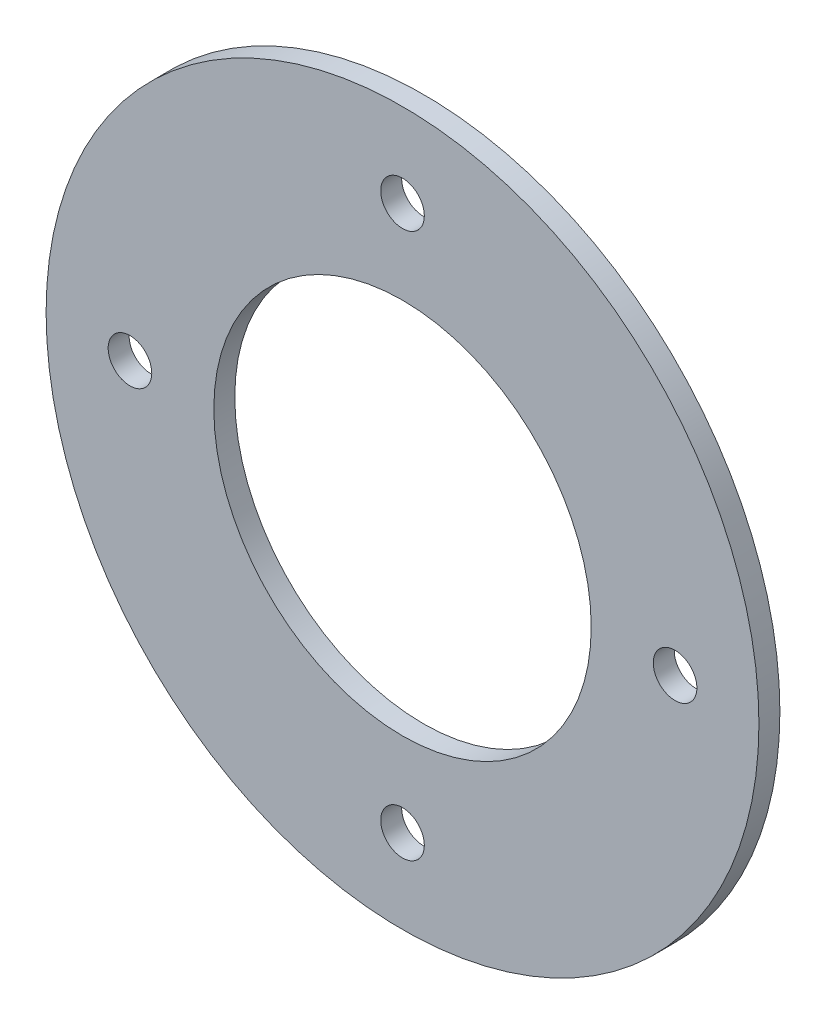
ISO-10303-21;
HEADER;
FILE_DESCRIPTION(('STEP AP214'),'2;1');
FILE_NAME('part.step','',(''),(''),'','','');
FILE_SCHEMA(('AUTOMOTIVE_DESIGN { 1 0 10303 214 1 1 1 1 }'));
ENDSEC;
DATA;
#1=APPLICATION_CONTEXT('core data for automotive mechanical design processes');
#2=APPLICATION_PROTOCOL_DEFINITION('international standard','automotive_design',2000,#1);
#3=PRODUCT_CONTEXT('',#1,'mechanical');
#4=PRODUCT('Part','Part','',(#3));
#5=PRODUCT_RELATED_PRODUCT_CATEGORY('part','',(#4));
#6=PRODUCT_DEFINITION_FORMATION('','',#4);
#7=PRODUCT_DEFINITION_CONTEXT('part definition',#1,'design');
#8=PRODUCT_DEFINITION('design','',#6,#7);
#9=PRODUCT_DEFINITION_SHAPE('','',#8);
#10=(LENGTH_UNIT() NAMED_UNIT(*) SI_UNIT(.MILLI.,.METRE.));
#11=(NAMED_UNIT(*) PLANE_ANGLE_UNIT() SI_UNIT($,.RADIAN.));
#12=(NAMED_UNIT(*) SI_UNIT($,.STERADIAN.) SOLID_ANGLE_UNIT());
#13=UNCERTAINTY_MEASURE_WITH_UNIT(LENGTH_MEASURE(1.E-05),#10,'distance_accuracy_value','');
#14=(GEOMETRIC_REPRESENTATION_CONTEXT(3) GLOBAL_UNCERTAINTY_ASSIGNED_CONTEXT((#13)) GLOBAL_UNIT_ASSIGNED_CONTEXT((#10,
#11,#12)) REPRESENTATION_CONTEXT('',''));
#15=CARTESIAN_POINT('',(0.,0.,0.));
#16=DIRECTION('',(0.,0.,1.));
#17=DIRECTION('',(1.,0.,0.));
#18=AXIS2_PLACEMENT_3D('',#15,#16,#17);
#19=CARTESIAN_POINT('',(0.,0.,-1.5875));
#20=DIRECTION('',(0.,0.,1.));
#21=DIRECTION('',(1.,0.,0.));
#22=AXIS2_PLACEMENT_3D('',#19,#20,#21);
#23=CYLINDRICAL_SURFACE('',#22,26.9875);
#24=CARTESIAN_POINT('',(0.,0.,-1.5875));
#25=DIRECTION('',(0.,0.,1.));
#26=DIRECTION('',(1.,0.,0.));
#27=AXIS2_PLACEMENT_3D('',#24,#25,#26);
#28=CIRCLE('',#27,26.9875);
#29=CARTESIAN_POINT('',(26.9875,0.,-1.5875));
#30=VERTEX_POINT('',#29);
#31=EDGE_CURVE('E10',#30,#30,#28,.T.);
#32=ORIENTED_EDGE('',*,*,#31,.T.);
#33=EDGE_LOOP('',(#32));
#34=FACE_BOUND('',#33,.T.);
#35=CARTESIAN_POINT('',(0.,0.,0.));
#36=DIRECTION('',(0.,0.,1.));
#37=DIRECTION('',(1.,0.,0.));
#38=AXIS2_PLACEMENT_3D('',#35,#36,#37);
#39=CIRCLE('',#38,26.9875);
#40=CARTESIAN_POINT('',(26.9875,0.,0.));
#41=VERTEX_POINT('',#40);
#42=EDGE_CURVE('E37',#41,#41,#39,.T.);
#43=ORIENTED_EDGE('',*,*,#42,.F.);
#44=EDGE_LOOP('',(#43));
#45=FACE_BOUND('',#44,.T.);
#46=ADVANCED_FACE('F34',(#34,#45),#23,.T.);
#47=CARTESIAN_POINT('',(0.,0.,-1.5875));
#48=DIRECTION('',(0.,0.,1.));
#49=DIRECTION('',(1.,0.,0.));
#50=AXIS2_PLACEMENT_3D('',#47,#48,#49);
#51=PLANE('',#50);
#52=CARTESIAN_POINT('',(0.,20.6375,-1.5875));
#53=DIRECTION('',(0.,0.,1.));
#54=DIRECTION('',(1.,0.,0.));
#55=AXIS2_PLACEMENT_3D('',#52,#53,#54);
#56=CIRCLE('',#55,1.651);
#57=CARTESIAN_POINT('',(1.651,20.6375,-1.5875));
#58=VERTEX_POINT('',#57);
#59=EDGE_CURVE('E49',#58,#58,#56,.T.);
#60=ORIENTED_EDGE('',*,*,#59,.T.);
#61=EDGE_LOOP('',(#60));
#62=FACE_BOUND('',#61,.T.);
#63=CARTESIAN_POINT('',(20.6375,0.,-1.5875));
#64=DIRECTION('',(0.,0.,1.));
#65=DIRECTION('',(1.,0.,0.));
#66=AXIS2_PLACEMENT_3D('',#63,#64,#65);
#67=CIRCLE('',#66,1.651);
#68=CARTESIAN_POINT('',(22.2885,0.,-1.5875));
#69=VERTEX_POINT('',#68);
#70=EDGE_CURVE('E67',#69,#69,#67,.T.);
#71=ORIENTED_EDGE('',*,*,#70,.T.);
#72=EDGE_LOOP('',(#71));
#73=FACE_BOUND('',#72,.T.);
#74=CARTESIAN_POINT('',(0.,-20.6375,-1.5875));
#75=DIRECTION('',(0.,0.,1.));
#76=DIRECTION('',(1.,0.,0.));
#77=AXIS2_PLACEMENT_3D('',#74,#75,#76);
#78=CIRCLE('',#77,1.651);
#79=CARTESIAN_POINT('',(1.651,-20.6375,-1.5875));
#80=VERTEX_POINT('',#79);
#81=EDGE_CURVE('E61',#80,#80,#78,.T.);
#82=ORIENTED_EDGE('',*,*,#81,.T.);
#83=EDGE_LOOP('',(#82));
#84=FACE_BOUND('',#83,.T.);
#85=CARTESIAN_POINT('',(-20.6375,0.,-1.5875));
#86=DIRECTION('',(0.,0.,1.));
#87=DIRECTION('',(1.,0.,0.));
#88=AXIS2_PLACEMENT_3D('',#85,#86,#87);
#89=CIRCLE('',#88,1.651);
#90=CARTESIAN_POINT('',(-18.9865,0.,-1.5875));
#91=VERTEX_POINT('',#90);
#92=EDGE_CURVE('E55',#91,#91,#89,.T.);
#93=ORIENTED_EDGE('',*,*,#92,.T.);
#94=EDGE_LOOP('',(#93));
#95=FACE_BOUND('',#94,.T.);
#96=CARTESIAN_POINT('',(0.,0.,-1.5875));
#97=DIRECTION('',(0.,0.,1.));
#98=DIRECTION('',(1.,0.,0.));
#99=AXIS2_PLACEMENT_3D('',#96,#97,#98);
#100=CIRCLE('',#99,14.2875);
#101=CARTESIAN_POINT('',(14.2875,0.,-1.5875));
#102=VERTEX_POINT('',#101);
#103=EDGE_CURVE('E44',#102,#102,#100,.T.);
#104=ORIENTED_EDGE('',*,*,#103,.T.);
#105=EDGE_LOOP('',(#104));
#106=FACE_BOUND('',#105,.T.);
#107=ORIENTED_EDGE('',*,*,#31,.F.);
#108=EDGE_LOOP('',(#107));
#109=FACE_BOUND('',#108,.T.);
#110=ADVANCED_FACE('F76',(#62,#73,#84,#95,#106,#109),#51,.F.);
#111=CARTESIAN_POINT('',(0.,0.,0.));
#112=DIRECTION('',(0.,0.,1.));
#113=DIRECTION('',(1.,0.,0.));
#114=AXIS2_PLACEMENT_3D('',#111,#112,#113);
#115=PLANE('',#114);
#116=CARTESIAN_POINT('',(0.,20.6375,0.));
#117=DIRECTION('',(0.,0.,1.));
#118=DIRECTION('',(1.,0.,0.));
#119=AXIS2_PLACEMENT_3D('',#116,#117,#118);
#120=CIRCLE('',#119,1.651);
#121=CARTESIAN_POINT('',(1.651,20.6375,0.));
#122=VERTEX_POINT('',#121);
#123=EDGE_CURVE('E70',#122,#122,#120,.T.);
#124=ORIENTED_EDGE('',*,*,#123,.F.);
#125=EDGE_LOOP('',(#124));
#126=FACE_BOUND('',#125,.T.);
#127=CARTESIAN_POINT('',(20.6375,0.,0.));
#128=DIRECTION('',(0.,0.,1.));
#129=DIRECTION('',(1.,0.,0.));
#130=AXIS2_PLACEMENT_3D('',#127,#128,#129);
#131=CIRCLE('',#130,1.651);
#132=CARTESIAN_POINT('',(22.2885,0.,0.));
#133=VERTEX_POINT('',#132);
#134=EDGE_CURVE('E64',#133,#133,#131,.T.);
#135=ORIENTED_EDGE('',*,*,#134,.F.);
#136=EDGE_LOOP('',(#135));
#137=FACE_BOUND('',#136,.T.);
#138=CARTESIAN_POINT('',(0.,-20.6375,0.));
#139=DIRECTION('',(0.,0.,1.));
#140=DIRECTION('',(1.,0.,0.));
#141=AXIS2_PLACEMENT_3D('',#138,#139,#140);
#142=CIRCLE('',#141,1.651);
#143=CARTESIAN_POINT('',(1.651,-20.6375,0.));
#144=VERTEX_POINT('',#143);
#145=EDGE_CURVE('E58',#144,#144,#142,.T.);
#146=ORIENTED_EDGE('',*,*,#145,.F.);
#147=EDGE_LOOP('',(#146));
#148=FACE_BOUND('',#147,.T.);
#149=CARTESIAN_POINT('',(-20.6375,0.,0.));
#150=DIRECTION('',(0.,0.,1.));
#151=DIRECTION('',(1.,0.,0.));
#152=AXIS2_PLACEMENT_3D('',#149,#150,#151);
#153=CIRCLE('',#152,1.651);
#154=CARTESIAN_POINT('',(-18.9865,0.,0.));
#155=VERTEX_POINT('',#154);
#156=EDGE_CURVE('E52',#155,#155,#153,.T.);
#157=ORIENTED_EDGE('',*,*,#156,.F.);
#158=EDGE_LOOP('',(#157));
#159=FACE_BOUND('',#158,.T.);
#160=CARTESIAN_POINT('',(0.,0.,0.));
#161=DIRECTION('',(0.,0.,1.));
#162=DIRECTION('',(1.,0.,0.));
#163=AXIS2_PLACEMENT_3D('',#160,#161,#162);
#164=CIRCLE('',#163,14.2875);
#165=CARTESIAN_POINT('',(14.2875,0.,0.));
#166=VERTEX_POINT('',#165);
#167=EDGE_CURVE('E46',#166,#166,#164,.T.);
#168=ORIENTED_EDGE('',*,*,#167,.F.);
#169=EDGE_LOOP('',(#168));
#170=FACE_BOUND('',#169,.T.);
#171=ORIENTED_EDGE('',*,*,#42,.T.);
#172=EDGE_LOOP('',(#171));
#173=FACE_BOUND('',#172,.T.);
#174=ADVANCED_FACE('F86',(#126,#137,#148,#159,#170,#173),#115,.T.);
#175=CARTESIAN_POINT('',(0.,0.,-1.5875));
#176=DIRECTION('',(0.,0.,1.));
#177=DIRECTION('',(1.,0.,0.));
#178=AXIS2_PLACEMENT_3D('',#175,#176,#177);
#179=CYLINDRICAL_SURFACE('',#178,14.2875);
#180=ORIENTED_EDGE('',*,*,#103,.F.);
#181=EDGE_LOOP('',(#180));
#182=FACE_BOUND('',#181,.T.);
#183=ORIENTED_EDGE('',*,*,#167,.T.);
#184=EDGE_LOOP('',(#183));
#185=FACE_BOUND('',#184,.T.);
#186=ADVANCED_FACE('F89',(#182,#185),#179,.F.);
#187=CARTESIAN_POINT('',(-20.6375,0.,-1.5875));
#188=DIRECTION('',(0.,0.,1.));
#189=DIRECTION('',(1.,0.,0.));
#190=AXIS2_PLACEMENT_3D('',#187,#188,#189);
#191=CYLINDRICAL_SURFACE('',#190,1.651);
#192=ORIENTED_EDGE('',*,*,#92,.F.);
#193=EDGE_LOOP('',(#192));
#194=FACE_BOUND('',#193,.T.);
#195=ORIENTED_EDGE('',*,*,#156,.T.);
#196=EDGE_LOOP('',(#195));
#197=FACE_BOUND('',#196,.T.);
#198=ADVANCED_FACE('F111',(#194,#197),#191,.F.);
#199=CARTESIAN_POINT('',(0.,-20.6375,-1.5875));
#200=DIRECTION('',(0.,0.,1.));
#201=DIRECTION('',(1.,0.,0.));
#202=AXIS2_PLACEMENT_3D('',#199,#200,#201);
#203=CYLINDRICAL_SURFACE('',#202,1.651);
#204=ORIENTED_EDGE('',*,*,#81,.F.);
#205=EDGE_LOOP('',(#204));
#206=FACE_BOUND('',#205,.T.);
#207=ORIENTED_EDGE('',*,*,#145,.T.);
#208=EDGE_LOOP('',(#207));
#209=FACE_BOUND('',#208,.T.);
#210=ADVANCED_FACE('F115',(#206,#209),#203,.F.);
#211=CARTESIAN_POINT('',(20.6375,0.,-1.5875));
#212=DIRECTION('',(0.,0.,1.));
#213=DIRECTION('',(1.,0.,0.));
#214=AXIS2_PLACEMENT_3D('',#211,#212,#213);
#215=CYLINDRICAL_SURFACE('',#214,1.651);
#216=ORIENTED_EDGE('',*,*,#70,.F.);
#217=EDGE_LOOP('',(#216));
#218=FACE_BOUND('',#217,.T.);
#219=ORIENTED_EDGE('',*,*,#134,.T.);
#220=EDGE_LOOP('',(#219));
#221=FACE_BOUND('',#220,.T.);
#222=ADVANCED_FACE('F82',(#218,#221),#215,.F.);
#223=CARTESIAN_POINT('',(0.,20.6375,-1.5875));
#224=DIRECTION('',(0.,0.,1.));
#225=DIRECTION('',(1.,0.,0.));
#226=AXIS2_PLACEMENT_3D('',#223,#224,#225);
#227=CYLINDRICAL_SURFACE('',#226,1.651);
#228=ORIENTED_EDGE('',*,*,#59,.F.);
#229=EDGE_LOOP('',(#228));
#230=FACE_BOUND('',#229,.T.);
#231=ORIENTED_EDGE('',*,*,#123,.T.);
#232=EDGE_LOOP('',(#231));
#233=FACE_BOUND('',#232,.T.);
#234=ADVANCED_FACE('F79',(#230,#233),#227,.F.);
#235=CLOSED_SHELL('',(#46,#110,#174,#186,#198,#210,#222,#234));
#236=MANIFOLD_SOLID_BREP('B2',#235);
#237=ADVANCED_BREP_SHAPE_REPRESENTATION('',(#18,#236),#14);
#238=SHAPE_DEFINITION_REPRESENTATION(#9,#237);
ENDSEC;
END-ISO-10303-21;
